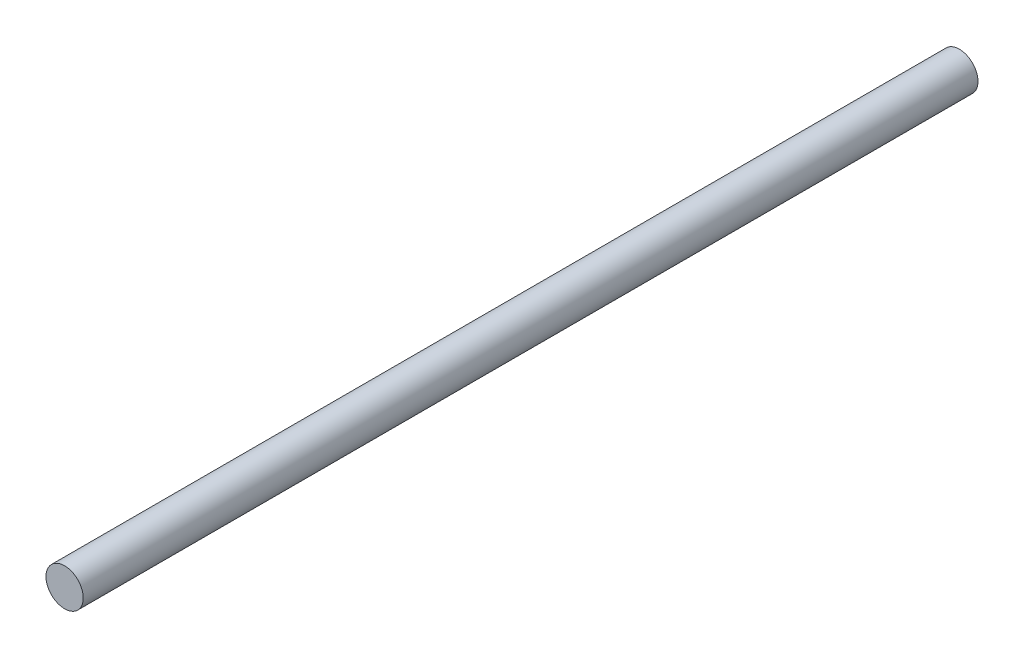
ISO-10303-21;
HEADER;
FILE_DESCRIPTION(('STEP AP214'),'2;1');
FILE_NAME('part.step','',(''),(''),'','','');
FILE_SCHEMA(('AUTOMOTIVE_DESIGN { 1 0 10303 214 1 1 1 1 }'));
ENDSEC;
DATA;
#1=APPLICATION_CONTEXT('core data for automotive mechanical design processes');
#2=APPLICATION_PROTOCOL_DEFINITION('international standard','automotive_design',2000,#1);
#3=PRODUCT_CONTEXT('',#1,'mechanical');
#4=PRODUCT('Part','Part','',(#3));
#5=PRODUCT_RELATED_PRODUCT_CATEGORY('part','',(#4));
#6=PRODUCT_DEFINITION_FORMATION('','',#4);
#7=PRODUCT_DEFINITION_CONTEXT('part definition',#1,'design');
#8=PRODUCT_DEFINITION('design','',#6,#7);
#9=PRODUCT_DEFINITION_SHAPE('','',#8);
#10=(LENGTH_UNIT() NAMED_UNIT(*) SI_UNIT(.MILLI.,.METRE.));
#11=(NAMED_UNIT(*) PLANE_ANGLE_UNIT() SI_UNIT($,.RADIAN.));
#12=(NAMED_UNIT(*) SI_UNIT($,.STERADIAN.) SOLID_ANGLE_UNIT());
#13=UNCERTAINTY_MEASURE_WITH_UNIT(LENGTH_MEASURE(1.E-05),#10,'distance_accuracy_value','');
#14=(GEOMETRIC_REPRESENTATION_CONTEXT(3) GLOBAL_UNCERTAINTY_ASSIGNED_CONTEXT((#13)) GLOBAL_UNIT_ASSIGNED_CONTEXT((#10,
#11,#12)) REPRESENTATION_CONTEXT('',''));
#15=CARTESIAN_POINT('',(0.,0.,0.));
#16=DIRECTION('',(0.,0.,1.));
#17=DIRECTION('',(1.,0.,0.));
#18=AXIS2_PLACEMENT_3D('',#15,#16,#17);
#19=CARTESIAN_POINT('',(0.,0.,762.));
#20=DIRECTION('',(0.,0.,-1.));
#21=DIRECTION('',(-1.,0.,0.));
#22=AXIS2_PLACEMENT_3D('',#19,#20,#21);
#23=CYLINDRICAL_SURFACE('',#22,15.875);
#24=CARTESIAN_POINT('',(0.,0.,762.));
#25=DIRECTION('',(0.,0.,1.));
#26=DIRECTION('',(1.,0.,0.));
#27=AXIS2_PLACEMENT_3D('',#24,#25,#26);
#28=CIRCLE('',#27,15.875);
#29=CARTESIAN_POINT('',(15.875,0.,762.));
#30=VERTEX_POINT('',#29);
#31=EDGE_CURVE('E10',#30,#30,#28,.T.);
#32=ORIENTED_EDGE('',*,*,#31,.F.);
#33=EDGE_LOOP('',(#32));
#34=FACE_BOUND('',#33,.T.);
#35=CARTESIAN_POINT('',(0.,0.,0.));
#36=DIRECTION('',(0.,0.,1.));
#37=DIRECTION('',(1.,0.,0.));
#38=AXIS2_PLACEMENT_3D('',#35,#36,#37);
#39=CIRCLE('',#38,15.875);
#40=CARTESIAN_POINT('',(15.875,0.,0.));
#41=VERTEX_POINT('',#40);
#42=EDGE_CURVE('E34',#41,#41,#39,.T.);
#43=ORIENTED_EDGE('',*,*,#42,.T.);
#44=EDGE_LOOP('',(#43));
#45=FACE_BOUND('',#44,.T.);
#46=ADVANCED_FACE('F31',(#34,#45),#23,.T.);
#47=CARTESIAN_POINT('',(0.,0.,762.));
#48=DIRECTION('',(0.,0.,1.));
#49=DIRECTION('',(1.,0.,0.));
#50=AXIS2_PLACEMENT_3D('',#47,#48,#49);
#51=PLANE('',#50);
#52=ORIENTED_EDGE('',*,*,#31,.T.);
#53=EDGE_LOOP('',(#52));
#54=FACE_BOUND('',#53,.T.);
#55=ADVANCED_FACE('F46',(#54),#51,.T.);
#56=CARTESIAN_POINT('',(0.,0.,0.));
#57=DIRECTION('',(0.,0.,1.));
#58=DIRECTION('',(1.,0.,0.));
#59=AXIS2_PLACEMENT_3D('',#56,#57,#58);
#60=PLANE('',#59);
#61=ORIENTED_EDGE('',*,*,#42,.F.);
#62=EDGE_LOOP('',(#61));
#63=FACE_BOUND('',#62,.T.);
#64=ADVANCED_FACE('F44',(#63),#60,.F.);
#65=CLOSED_SHELL('',(#46,#55,#64));
#66=MANIFOLD_SOLID_BREP('B2',#65);
#67=ADVANCED_BREP_SHAPE_REPRESENTATION('',(#18,#66),#14);
#68=SHAPE_DEFINITION_REPRESENTATION(#9,#67);
ENDSEC;
END-ISO-10303-21;
